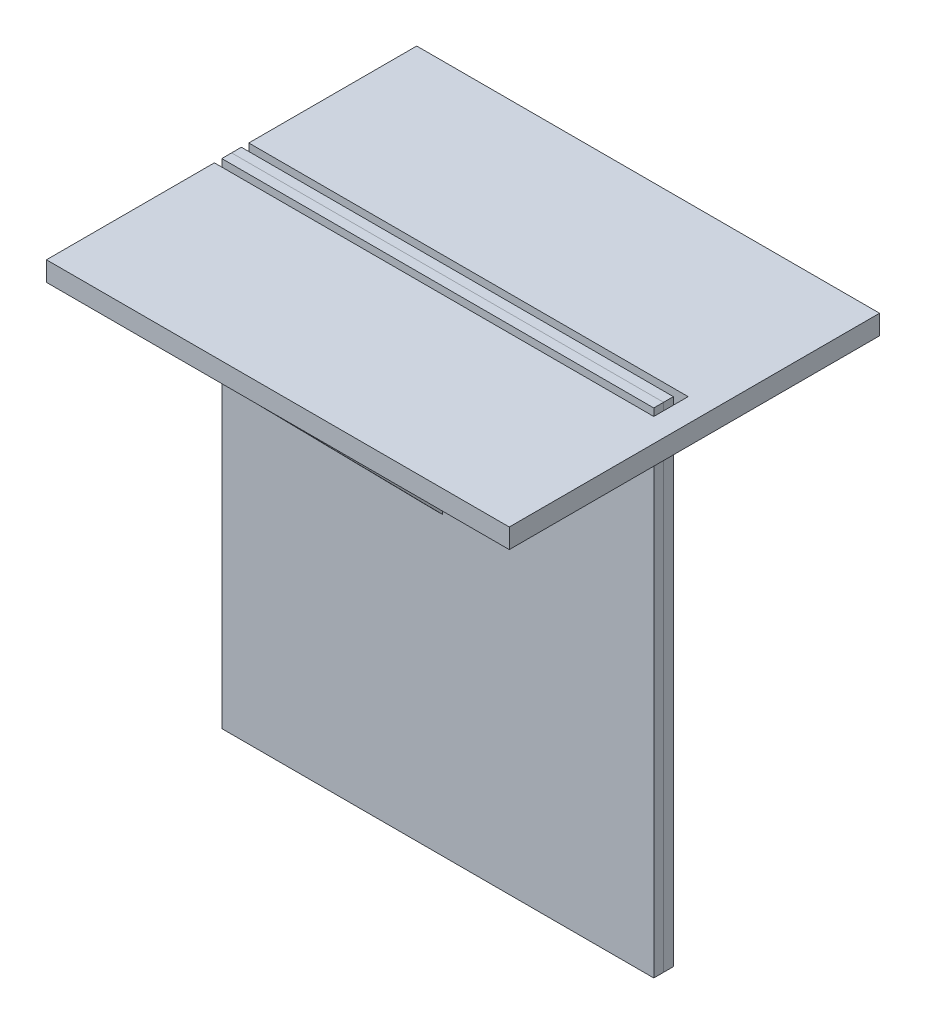
ISO-10303-21;
HEADER;
FILE_DESCRIPTION(('STEP AP214'),'2;1');
FILE_NAME('part.step','',(''),(''),'','','');
FILE_SCHEMA(('AUTOMOTIVE_DESIGN { 1 0 10303 214 1 1 1 1 }'));
ENDSEC;
DATA;
#1=APPLICATION_CONTEXT('core data for automotive mechanical design processes');
#2=APPLICATION_PROTOCOL_DEFINITION('international standard','automotive_design',2000,#1);
#3=PRODUCT_CONTEXT('',#1,'mechanical');
#4=PRODUCT('Part','Part','',(#3));
#5=PRODUCT_RELATED_PRODUCT_CATEGORY('part','',(#4));
#6=PRODUCT_DEFINITION_FORMATION('','',#4);
#7=PRODUCT_DEFINITION_CONTEXT('part definition',#1,'design');
#8=PRODUCT_DEFINITION('design','',#6,#7);
#9=PRODUCT_DEFINITION_SHAPE('','',#8);
#10=(LENGTH_UNIT() NAMED_UNIT(*) SI_UNIT(.MILLI.,.METRE.));
#11=(NAMED_UNIT(*) PLANE_ANGLE_UNIT() SI_UNIT($,.RADIAN.));
#12=(NAMED_UNIT(*) SI_UNIT($,.STERADIAN.) SOLID_ANGLE_UNIT());
#13=UNCERTAINTY_MEASURE_WITH_UNIT(LENGTH_MEASURE(1.E-05),#10,'distance_accuracy_value','');
#14=(GEOMETRIC_REPRESENTATION_CONTEXT(3) GLOBAL_UNCERTAINTY_ASSIGNED_CONTEXT((#13)) GLOBAL_UNIT_ASSIGNED_CONTEXT((#10,
#11,#12)) REPRESENTATION_CONTEXT('',''));
#15=CARTESIAN_POINT('',(0.,0.,0.));
#16=DIRECTION('',(0.,0.,1.));
#17=DIRECTION('',(1.,0.,0.));
#18=AXIS2_PLACEMENT_3D('',#15,#16,#17);
#19=CARTESIAN_POINT('',(-0.79375,45.825,1.5875));
#20=DIRECTION('',(0.,-1.,0.));
#21=DIRECTION('',(0.,0.,-1.));
#22=AXIS2_PLACEMENT_3D('',#19,#20,#21);
#23=PLANE('',#22);
#24=DIRECTION('',(0.,0.,-1.));
#25=VECTOR('',#24,1.);
#26=CARTESIAN_POINT('',(0.79375,45.825,1.5875));
#27=LINE('',#26,#25);
#28=CARTESIAN_POINT('',(0.79375,45.825,30.));
#29=VERTEX_POINT('',#28);
#30=CARTESIAN_POINT('',(0.79375,45.825,1.5875));
#31=VERTEX_POINT('',#30);
#32=EDGE_CURVE('E101',#29,#31,#27,.T.);
#33=ORIENTED_EDGE('',*,*,#32,.T.);
#34=DIRECTION('',(1.,0.,0.));
#35=VECTOR('',#34,1.);
#36=CARTESIAN_POINT('',(-0.79375,45.825,1.5875));
#37=LINE('',#36,#35);
#38=CARTESIAN_POINT('',(-0.79375,45.825,1.5875));
#39=VERTEX_POINT('',#38);
#40=EDGE_CURVE('E12',#39,#31,#37,.T.);
#41=ORIENTED_EDGE('',*,*,#40,.F.);
#42=DIRECTION('',(0.,0.,-1.));
#43=VECTOR('',#42,1.);
#44=CARTESIAN_POINT('',(-0.79375,45.825,1.5875));
#45=LINE('',#44,#43);
#46=CARTESIAN_POINT('',(-0.79375,45.825,30.));
#47=VERTEX_POINT('',#46);
#48=EDGE_CURVE('E94',#47,#39,#45,.T.);
#49=ORIENTED_EDGE('',*,*,#48,.F.);
#50=DIRECTION('',(1.,0.,0.));
#51=VECTOR('',#50,1.);
#52=CARTESIAN_POINT('',(-0.79375,45.825,30.));
#53=LINE('',#52,#51);
#54=EDGE_CURVE('E102',#47,#29,#53,.T.);
#55=ORIENTED_EDGE('',*,*,#54,.T.);
#56=EDGE_LOOP('',(#33,#41,#49,#55));
#57=FACE_BOUND('',#56,.T.);
#58=ADVANCED_FACE('F54',(#57),#23,.F.);
#59=CARTESIAN_POINT('',(-0.79375,16.9341740766103,1.5875));
#60=DIRECTION('',(0.,0.,1.));
#61=DIRECTION('',(0.,-1.,0.));
#62=AXIS2_PLACEMENT_3D('',#59,#60,#61);
#63=PLANE('',#62);
#64=DIRECTION('',(0.,-1.,0.));
#65=VECTOR('',#64,1.);
#66=CARTESIAN_POINT('',(0.79375,16.9341740766103,1.5875));
#67=LINE('',#66,#65);
#68=CARTESIAN_POINT('',(0.79375,16.9341740766103,1.5875));
#69=VERTEX_POINT('',#68);
#70=EDGE_CURVE('E82',#31,#69,#67,.T.);
#71=ORIENTED_EDGE('',*,*,#70,.T.);
#72=DIRECTION('',(1.,0.,0.));
#73=VECTOR('',#72,1.);
#74=CARTESIAN_POINT('',(-0.79375,16.9341740766103,1.5875));
#75=LINE('',#74,#73);
#76=CARTESIAN_POINT('',(-0.79375,16.9341740766103,1.5875));
#77=VERTEX_POINT('',#76);
#78=EDGE_CURVE('E62',#77,#69,#75,.T.);
#79=ORIENTED_EDGE('',*,*,#78,.F.);
#80=DIRECTION('',(0.,-1.,0.));
#81=VECTOR('',#80,1.);
#82=CARTESIAN_POINT('',(-0.79375,16.9341740766103,1.5875));
#83=LINE('',#82,#81);
#84=EDGE_CURVE('E90',#39,#77,#83,.T.);
#85=ORIENTED_EDGE('',*,*,#84,.F.);
#86=ORIENTED_EDGE('',*,*,#40,.T.);
#87=EDGE_LOOP('',(#71,#79,#85,#86));
#88=FACE_BOUND('',#87,.T.);
#89=ADVANCED_FACE('F91',(#88),#63,.F.);
#90=CARTESIAN_POINT('',(-0.79375,45.825,30.));
#91=DIRECTION('',(0.,0.701179947463391,-0.712984348548575));
#92=DIRECTION('',(0.,0.712984348548575,0.701179947463391));
#93=AXIS2_PLACEMENT_3D('',#90,#91,#92);
#94=PLANE('',#93);
#95=DIRECTION('',(0.,0.712984348548575,0.701179947463391));
#96=VECTOR('',#95,1.);
#97=CARTESIAN_POINT('',(0.79375,45.825,30.));
#98=LINE('',#97,#96);
#99=EDGE_CURVE('E87',#69,#29,#98,.T.);
#100=ORIENTED_EDGE('',*,*,#99,.T.);
#101=ORIENTED_EDGE('',*,*,#54,.F.);
#102=DIRECTION('',(0.,0.712984348548575,0.701179947463391));
#103=VECTOR('',#102,1.);
#104=CARTESIAN_POINT('',(-0.79375,45.825,30.));
#105=LINE('',#104,#103);
#106=EDGE_CURVE('E70',#77,#47,#105,.T.);
#107=ORIENTED_EDGE('',*,*,#106,.F.);
#108=ORIENTED_EDGE('',*,*,#78,.T.);
#109=EDGE_LOOP('',(#100,#101,#107,#108));
#110=FACE_BOUND('',#109,.T.);
#111=ADVANCED_FACE('F109',(#110),#94,.F.);
#112=CARTESIAN_POINT('',(-0.79375,0.,0.));
#113=DIRECTION('',(-1.,0.,0.));
#114=DIRECTION('',(0.,0.,1.));
#115=AXIS2_PLACEMENT_3D('',#112,#113,#114);
#116=PLANE('',#115);
#117=ORIENTED_EDGE('',*,*,#48,.T.);
#118=ORIENTED_EDGE('',*,*,#84,.T.);
#119=ORIENTED_EDGE('',*,*,#106,.T.);
#120=EDGE_LOOP('',(#117,#118,#119));
#121=FACE_BOUND('',#120,.T.);
#122=ADVANCED_FACE('F97',(#121),#116,.T.);
#123=CARTESIAN_POINT('',(0.79375,0.,0.));
#124=DIRECTION('',(-1.,0.,0.));
#125=DIRECTION('',(0.,0.,1.));
#126=AXIS2_PLACEMENT_3D('',#123,#124,#125);
#127=PLANE('',#126);
#128=ORIENTED_EDGE('',*,*,#32,.F.);
#129=ORIENTED_EDGE('',*,*,#99,.F.);
#130=ORIENTED_EDGE('',*,*,#70,.F.);
#131=EDGE_LOOP('',(#128,#129,#130));
#132=FACE_BOUND('',#131,.T.);
#133=ADVANCED_FACE('F110',(#132),#127,.F.);
#134=CLOSED_SHELL('',(#58,#89,#111,#122,#133));
#135=MANIFOLD_SOLID_BREP('B2',#134);
#136=CARTESIAN_POINT('',(-35.,45.825,30.));
#137=DIRECTION('',(1.,0.,0.));
#138=DIRECTION('',(0.,0.,-1.));
#139=AXIS2_PLACEMENT_3D('',#136,#137,#138);
#140=PLANE('',#139);
#141=DIRECTION('',(0.,0.,-1.));
#142=VECTOR('',#141,1.);
#143=CARTESIAN_POINT('',(-35.,49.,30.));
#144=LINE('',#143,#142);
#145=CARTESIAN_POINT('',(-35.,49.,30.));
#146=VERTEX_POINT('',#145);
#147=CARTESIAN_POINT('',(-35.,49.,2.7875));
#148=VERTEX_POINT('',#147);
#149=EDGE_CURVE('E273',#146,#148,#144,.T.);
#150=ORIENTED_EDGE('',*,*,#149,.T.);
#151=DIRECTION('',(0.,1.,0.));
#152=VECTOR('',#151,1.);
#153=CARTESIAN_POINT('',(-35.,45.825,2.7875));
#154=LINE('',#153,#152);
#155=CARTESIAN_POINT('',(-35.,45.825,2.7875));
#156=VERTEX_POINT('',#155);
#157=EDGE_CURVE('E52',#156,#148,#154,.T.);
#158=ORIENTED_EDGE('',*,*,#157,.F.);
#159=DIRECTION('',(0.,0.,-1.));
#160=VECTOR('',#159,1.);
#161=CARTESIAN_POINT('',(-35.,45.825,30.));
#162=LINE('',#161,#160);
#163=CARTESIAN_POINT('',(-35.,45.825,30.));
#164=VERTEX_POINT('',#163);
#165=EDGE_CURVE('E296',#164,#156,#162,.T.);
#166=ORIENTED_EDGE('',*,*,#165,.F.);
#167=DIRECTION('',(0.,1.,0.));
#168=VECTOR('',#167,1.);
#169=CARTESIAN_POINT('',(-35.,45.825,30.));
#170=LINE('',#169,#168);
#171=EDGE_CURVE('E269',#164,#146,#170,.T.);
#172=ORIENTED_EDGE('',*,*,#171,.T.);
#173=EDGE_LOOP('',(#150,#158,#166,#172));
#174=FACE_BOUND('',#173,.T.);
#175=ADVANCED_FACE('F172',(#174),#140,.F.);
#176=CARTESIAN_POINT('',(-35.,45.825,2.7875));
#177=DIRECTION('',(0.,0.,1.));
#178=DIRECTION('',(0.,-1.,0.));
#179=AXIS2_PLACEMENT_3D('',#176,#177,#178);
#180=PLANE('',#179);
#181=DIRECTION('',(1.,0.,0.));
#182=VECTOR('',#181,1.);
#183=CARTESIAN_POINT('',(-35.,49.,2.7875));
#184=LINE('',#183,#182);
#185=CARTESIAN_POINT('',(36.2,49.,2.7875));
#186=VERTEX_POINT('',#185);
#187=EDGE_CURVE('E277',#148,#186,#184,.T.);
#188=ORIENTED_EDGE('',*,*,#187,.T.);
#189=DIRECTION('',(0.,1.,0.));
#190=VECTOR('',#189,1.);
#191=CARTESIAN_POINT('',(36.2,45.825,2.7875));
#192=LINE('',#191,#190);
#193=CARTESIAN_POINT('',(36.2,45.825,2.7875));
#194=VERTEX_POINT('',#193);
#195=EDGE_CURVE('E181',#194,#186,#192,.T.);
#196=ORIENTED_EDGE('',*,*,#195,.F.);
#197=DIRECTION('',(1.,0.,0.));
#198=VECTOR('',#197,1.);
#199=CARTESIAN_POINT('',(-35.,45.825,2.7875));
#200=LINE('',#199,#198);
#201=EDGE_CURVE('E232',#156,#194,#200,.T.);
#202=ORIENTED_EDGE('',*,*,#201,.F.);
#203=ORIENTED_EDGE('',*,*,#157,.T.);
#204=EDGE_LOOP('',(#188,#196,#202,#203));
#205=FACE_BOUND('',#204,.T.);
#206=ADVANCED_FACE('F317',(#205),#180,.F.);
#207=CARTESIAN_POINT('',(36.2,45.825,0.));
#208=DIRECTION('',(1.,0.,0.));
#209=DIRECTION('',(0.,1.,0.));
#210=AXIS2_PLACEMENT_3D('',#207,#208,#209);
#211=PLANE('',#210);
#212=DIRECTION('',(0.,0.,-1.));
#213=VECTOR('',#212,1.);
#214=CARTESIAN_POINT('',(36.2,49.,0.));
#215=LINE('',#214,#213);
#216=CARTESIAN_POINT('',(36.2,49.,-2.7875));
#217=VERTEX_POINT('',#216);
#218=EDGE_CURVE('E281',#186,#217,#215,.T.);
#219=ORIENTED_EDGE('',*,*,#218,.T.);
#220=DIRECTION('',(0.,1.,0.));
#221=VECTOR('',#220,1.);
#222=CARTESIAN_POINT('',(36.2,45.825,-2.7875));
#223=LINE('',#222,#221);
#224=CARTESIAN_POINT('',(36.2,45.825,-2.7875));
#225=VERTEX_POINT('',#224);
#226=EDGE_CURVE('E307',#225,#217,#223,.T.);
#227=ORIENTED_EDGE('',*,*,#226,.F.);
#228=DIRECTION('',(0.,0.,-1.));
#229=VECTOR('',#228,1.);
#230=CARTESIAN_POINT('',(36.2,45.825,2.7875));
#231=LINE('',#230,#229);
#232=EDGE_CURVE('E316',#194,#225,#231,.T.);
#233=ORIENTED_EDGE('',*,*,#232,.F.);
#234=ORIENTED_EDGE('',*,*,#195,.T.);
#235=EDGE_LOOP('',(#219,#227,#233,#234));
#236=FACE_BOUND('',#235,.T.);
#237=ADVANCED_FACE('F314',(#236),#211,.F.);
#238=CARTESIAN_POINT('',(36.2,45.825,-2.7875));
#239=DIRECTION('',(0.,0.,-1.));
#240=DIRECTION('',(0.,1.,0.));
#241=AXIS2_PLACEMENT_3D('',#238,#239,#240);
#242=PLANE('',#241);
#243=DIRECTION('',(-1.,0.,0.));
#244=VECTOR('',#243,1.);
#245=CARTESIAN_POINT('',(36.2,49.,-2.7875));
#246=LINE('',#245,#244);
#247=CARTESIAN_POINT('',(-35.,49.,-2.7875));
#248=VERTEX_POINT('',#247);
#249=EDGE_CURVE('E284',#217,#248,#246,.T.);
#250=ORIENTED_EDGE('',*,*,#249,.T.);
#251=DIRECTION('',(0.,1.,0.));
#252=VECTOR('',#251,1.);
#253=CARTESIAN_POINT('',(-35.,45.825,-2.7875));
#254=LINE('',#253,#252);
#255=CARTESIAN_POINT('',(-35.,45.825,-2.7875));
#256=VERTEX_POINT('',#255);
#257=EDGE_CURVE('E303',#256,#248,#254,.T.);
#258=ORIENTED_EDGE('',*,*,#257,.F.);
#259=DIRECTION('',(-1.,0.,0.));
#260=VECTOR('',#259,1.);
#261=CARTESIAN_POINT('',(36.2,45.825,-2.7875));
#262=LINE('',#261,#260);
#263=EDGE_CURVE('E331',#225,#256,#262,.T.);
#264=ORIENTED_EDGE('',*,*,#263,.F.);
#265=ORIENTED_EDGE('',*,*,#226,.T.);
#266=EDGE_LOOP('',(#250,#258,#264,#265));
#267=FACE_BOUND('',#266,.T.);
#268=ADVANCED_FACE('F326',(#267),#242,.F.);
#269=CARTESIAN_POINT('',(-35.,45.825,-2.7875));
#270=DIRECTION('',(1.,0.,0.));
#271=DIRECTION('',(0.,0.,-1.));
#272=AXIS2_PLACEMENT_3D('',#269,#270,#271);
#273=PLANE('',#272);
#274=DIRECTION('',(0.,0.,-1.));
#275=VECTOR('',#274,1.);
#276=CARTESIAN_POINT('',(-35.,49.,-2.7875));
#277=LINE('',#276,#275);
#278=CARTESIAN_POINT('',(-35.,49.,-30.));
#279=VERTEX_POINT('',#278);
#280=EDGE_CURVE('E287',#248,#279,#277,.T.);
#281=ORIENTED_EDGE('',*,*,#280,.T.);
#282=DIRECTION('',(0.,1.,0.));
#283=VECTOR('',#282,1.);
#284=CARTESIAN_POINT('',(-35.,45.825,-30.));
#285=LINE('',#284,#283);
#286=CARTESIAN_POINT('',(-35.,45.825,-30.));
#287=VERTEX_POINT('',#286);
#288=EDGE_CURVE('E262',#287,#279,#285,.T.);
#289=ORIENTED_EDGE('',*,*,#288,.F.);
#290=DIRECTION('',(0.,0.,-1.));
#291=VECTOR('',#290,1.);
#292=CARTESIAN_POINT('',(-35.,45.825,-2.7875));
#293=LINE('',#292,#291);
#294=EDGE_CURVE('E251',#256,#287,#293,.T.);
#295=ORIENTED_EDGE('',*,*,#294,.F.);
#296=ORIENTED_EDGE('',*,*,#257,.T.);
#297=EDGE_LOOP('',(#281,#289,#295,#296));
#298=FACE_BOUND('',#297,.T.);
#299=ADVANCED_FACE('F329',(#298),#273,.F.);
#300=CARTESIAN_POINT('',(-35.,45.825,-30.));
#301=DIRECTION('',(0.,0.,1.));
#302=DIRECTION('',(1.,0.,0.));
#303=AXIS2_PLACEMENT_3D('',#300,#301,#302);
#304=PLANE('',#303);
#305=DIRECTION('',(1.,0.,0.));
#306=VECTOR('',#305,1.);
#307=CARTESIAN_POINT('',(-35.,49.,-30.));
#308=LINE('',#307,#306);
#309=CARTESIAN_POINT('',(40.,49.,-30.));
#310=VERTEX_POINT('',#309);
#311=EDGE_CURVE('E260',#279,#310,#308,.T.);
#312=ORIENTED_EDGE('',*,*,#311,.T.);
#313=DIRECTION('',(0.,1.,0.));
#314=VECTOR('',#313,1.);
#315=CARTESIAN_POINT('',(40.,45.825,-30.));
#316=LINE('',#315,#314);
#317=CARTESIAN_POINT('',(40.,45.825,-30.));
#318=VERTEX_POINT('',#317);
#319=EDGE_CURVE('E257',#318,#310,#316,.T.);
#320=ORIENTED_EDGE('',*,*,#319,.F.);
#321=DIRECTION('',(1.,0.,0.));
#322=VECTOR('',#321,1.);
#323=CARTESIAN_POINT('',(-35.,45.825,-30.));
#324=LINE('',#323,#322);
#325=EDGE_CURVE('E245',#287,#318,#324,.T.);
#326=ORIENTED_EDGE('',*,*,#325,.F.);
#327=ORIENTED_EDGE('',*,*,#288,.T.);
#328=EDGE_LOOP('',(#312,#320,#326,#327));
#329=FACE_BOUND('',#328,.T.);
#330=ADVANCED_FACE('F258',(#329),#304,.F.);
#331=CARTESIAN_POINT('',(40.,45.825,30.));
#332=DIRECTION('',(-1.,0.,0.));
#333=DIRECTION('',(0.,-1.,0.));
#334=AXIS2_PLACEMENT_3D('',#331,#332,#333);
#335=PLANE('',#334);
#336=DIRECTION('',(0.,0.,1.));
#337=VECTOR('',#336,1.);
#338=CARTESIAN_POINT('',(40.,49.,30.));
#339=LINE('',#338,#337);
#340=CARTESIAN_POINT('',(40.,49.,30.));
#341=VERTEX_POINT('',#340);
#342=EDGE_CURVE('E218',#310,#341,#339,.T.);
#343=ORIENTED_EDGE('',*,*,#342,.T.);
#344=DIRECTION('',(0.,1.,0.));
#345=VECTOR('',#344,1.);
#346=CARTESIAN_POINT('',(40.,45.825,30.));
#347=LINE('',#346,#345);
#348=CARTESIAN_POINT('',(40.,45.825,30.));
#349=VERTEX_POINT('',#348);
#350=EDGE_CURVE('E263',#349,#341,#347,.T.);
#351=ORIENTED_EDGE('',*,*,#350,.F.);
#352=DIRECTION('',(0.,0.,1.));
#353=VECTOR('',#352,1.);
#354=CARTESIAN_POINT('',(40.,45.825,30.));
#355=LINE('',#354,#353);
#356=EDGE_CURVE('E249',#318,#349,#355,.T.);
#357=ORIENTED_EDGE('',*,*,#356,.F.);
#358=ORIENTED_EDGE('',*,*,#319,.T.);
#359=EDGE_LOOP('',(#343,#351,#357,#358));
#360=FACE_BOUND('',#359,.T.);
#361=ADVANCED_FACE('F265',(#360),#335,.F.);
#362=CARTESIAN_POINT('',(-35.,45.825,30.));
#363=DIRECTION('',(0.,0.,-1.));
#364=DIRECTION('',(-1.,0.,0.));
#365=AXIS2_PLACEMENT_3D('',#362,#363,#364);
#366=PLANE('',#365);
#367=DIRECTION('',(-1.,0.,0.));
#368=VECTOR('',#367,1.);
#369=CARTESIAN_POINT('',(-35.,49.,30.));
#370=LINE('',#369,#368);
#371=EDGE_CURVE('E224',#341,#146,#370,.T.);
#372=ORIENTED_EDGE('',*,*,#371,.T.);
#373=ORIENTED_EDGE('',*,*,#171,.F.);
#374=DIRECTION('',(-1.,0.,0.));
#375=VECTOR('',#374,1.);
#376=CARTESIAN_POINT('',(-35.,45.825,30.));
#377=LINE('',#376,#375);
#378=EDGE_CURVE('E189',#349,#164,#377,.T.);
#379=ORIENTED_EDGE('',*,*,#378,.F.);
#380=ORIENTED_EDGE('',*,*,#350,.T.);
#381=EDGE_LOOP('',(#372,#373,#379,#380));
#382=FACE_BOUND('',#381,.T.);
#383=ADVANCED_FACE('F342',(#382),#366,.F.);
#384=CARTESIAN_POINT('',(0.,45.825,0.));
#385=DIRECTION('',(0.,-1.,0.));
#386=DIRECTION('',(0.,0.,-1.));
#387=AXIS2_PLACEMENT_3D('',#384,#385,#386);
#388=PLANE('',#387);
#389=ORIENTED_EDGE('',*,*,#165,.T.);
#390=ORIENTED_EDGE('',*,*,#201,.T.);
#391=ORIENTED_EDGE('',*,*,#232,.T.);
#392=ORIENTED_EDGE('',*,*,#263,.T.);
#393=ORIENTED_EDGE('',*,*,#294,.T.);
#394=ORIENTED_EDGE('',*,*,#325,.T.);
#395=ORIENTED_EDGE('',*,*,#356,.T.);
#396=ORIENTED_EDGE('',*,*,#378,.T.);
#397=EDGE_LOOP('',(#389,#390,#391,#392,#393,#394,#395,#396));
#398=FACE_BOUND('',#397,.T.);
#399=ADVANCED_FACE('F247',(#398),#388,.T.);
#400=CARTESIAN_POINT('',(0.,49.,0.));
#401=DIRECTION('',(0.,-1.,0.));
#402=DIRECTION('',(0.,0.,-1.));
#403=AXIS2_PLACEMENT_3D('',#400,#401,#402);
#404=PLANE('',#403);
#405=ORIENTED_EDGE('',*,*,#149,.F.);
#406=ORIENTED_EDGE('',*,*,#371,.F.);
#407=ORIENTED_EDGE('',*,*,#342,.F.);
#408=ORIENTED_EDGE('',*,*,#311,.F.);
#409=ORIENTED_EDGE('',*,*,#280,.F.);
#410=ORIENTED_EDGE('',*,*,#249,.F.);
#411=ORIENTED_EDGE('',*,*,#218,.F.);
#412=ORIENTED_EDGE('',*,*,#187,.F.);
#413=EDGE_LOOP('',(#405,#406,#407,#408,#409,#410,#411,#412));
#414=FACE_BOUND('',#413,.T.);
#415=ADVANCED_FACE('F321',(#414),#404,.F.);
#416=CLOSED_SHELL('',(#175,#206,#237,#268,#299,#330,#361,#383,#399,#415));
#417=MANIFOLD_SOLID_BREP('B6',#416);
#418=CARTESIAN_POINT('',(0.,0.,-1.5875));
#419=DIRECTION('',(0.,0.,-1.));
#420=DIRECTION('',(-1.,0.,0.));
#421=AXIS2_PLACEMENT_3D('',#418,#419,#420);
#422=PLANE('',#421);
#423=DIRECTION('',(1.,0.,0.));
#424=VECTOR('',#423,1.);
#425=CARTESIAN_POINT('',(-35.,49.,-1.5875));
#426=LINE('',#425,#424);
#427=CARTESIAN_POINT('',(-35.,49.,-1.5875));
#428=VERTEX_POINT('',#427);
#429=CARTESIAN_POINT('',(35.,49.,-1.5875));
#430=VERTEX_POINT('',#429);
#431=EDGE_CURVE('E508',#428,#430,#426,.T.);
#432=ORIENTED_EDGE('',*,*,#431,.T.);
#433=DIRECTION('',(0.,-1.,0.));
#434=VECTOR('',#433,1.);
#435=CARTESIAN_POINT('',(35.,49.,-1.5875));
#436=LINE('',#435,#434);
#437=CARTESIAN_POINT('',(35.,-31.,-1.5875));
#438=VERTEX_POINT('',#437);
#439=EDGE_CURVE('E503',#430,#438,#436,.T.);
#440=ORIENTED_EDGE('',*,*,#439,.T.);
#441=DIRECTION('',(-1.,0.,0.));
#442=VECTOR('',#441,1.);
#443=CARTESIAN_POINT('',(35.,-31.,-1.5875));
#444=LINE('',#443,#442);
#445=CARTESIAN_POINT('',(-35.,-31.,-1.5875));
#446=VERTEX_POINT('',#445);
#447=EDGE_CURVE('E506',#438,#446,#444,.T.);
#448=ORIENTED_EDGE('',*,*,#447,.T.);
#449=DIRECTION('',(0.,1.,0.));
#450=VECTOR('',#449,1.);
#451=CARTESIAN_POINT('',(-35.,-31.,-1.5875));
#452=LINE('',#451,#450);
#453=EDGE_CURVE('E473',#446,#428,#452,.T.);
#454=ORIENTED_EDGE('',*,*,#453,.T.);
#455=EDGE_LOOP('',(#432,#440,#448,#454));
#456=FACE_BOUND('',#455,.T.);
#457=CARTESIAN_POINT('',(0.,0.,-1.5875));
#458=DIRECTION('',(0.,0.,-1.));
#459=DIRECTION('',(-1.,0.,0.));
#460=AXIS2_PLACEMENT_3D('',#457,#458,#459);
#461=CIRCLE('',#460,18.2500000000008);
#462=CARTESIAN_POINT('',(-18.2500000000008,0.,-1.5875));
#463=VERTEX_POINT('',#462);
#464=EDGE_CURVE('E523',#463,#463,#461,.T.);
#465=ORIENTED_EDGE('',*,*,#464,.F.);
#466=EDGE_LOOP('',(#465));
#467=FACE_BOUND('',#466,.T.);
#468=ADVANCED_FACE('F456',(#456,#467),#422,.T.);
#469=CARTESIAN_POINT('',(0.,0.,0.));
#470=DIRECTION('',(0.,0.,-1.));
#471=DIRECTION('',(-1.,0.,0.));
#472=AXIS2_PLACEMENT_3D('',#469,#470,#471);
#473=PLANE('',#472);
#474=DIRECTION('',(1.,0.,0.));
#475=VECTOR('',#474,1.);
#476=CARTESIAN_POINT('',(-35.,49.,0.));
#477=LINE('',#476,#475);
#478=CARTESIAN_POINT('',(-35.,49.,0.));
#479=VERTEX_POINT('',#478);
#480=CARTESIAN_POINT('',(35.,49.,0.));
#481=VERTEX_POINT('',#480);
#482=EDGE_CURVE('E520',#479,#481,#477,.T.);
#483=ORIENTED_EDGE('',*,*,#482,.F.);
#484=DIRECTION('',(0.,1.,0.));
#485=VECTOR('',#484,1.);
#486=CARTESIAN_POINT('',(-35.,-31.,0.));
#487=LINE('',#486,#485);
#488=CARTESIAN_POINT('',(-35.,-31.,0.));
#489=VERTEX_POINT('',#488);
#490=EDGE_CURVE('E496',#489,#479,#487,.T.);
#491=ORIENTED_EDGE('',*,*,#490,.F.);
#492=DIRECTION('',(-1.,0.,0.));
#493=VECTOR('',#492,1.);
#494=CARTESIAN_POINT('',(35.,-31.,0.));
#495=LINE('',#494,#493);
#496=CARTESIAN_POINT('',(35.,-31.,0.));
#497=VERTEX_POINT('',#496);
#498=EDGE_CURVE('E490',#497,#489,#495,.T.);
#499=ORIENTED_EDGE('',*,*,#498,.F.);
#500=DIRECTION('',(0.,-1.,0.));
#501=VECTOR('',#500,1.);
#502=CARTESIAN_POINT('',(35.,49.,0.));
#503=LINE('',#502,#501);
#504=EDGE_CURVE('E512',#481,#497,#503,.T.);
#505=ORIENTED_EDGE('',*,*,#504,.F.);
#506=EDGE_LOOP('',(#483,#491,#499,#505));
#507=FACE_BOUND('',#506,.T.);
#508=CARTESIAN_POINT('',(0.,0.,0.));
#509=DIRECTION('',(0.,0.,-1.));
#510=DIRECTION('',(-1.,0.,0.));
#511=AXIS2_PLACEMENT_3D('',#508,#509,#510);
#512=CIRCLE('',#511,18.2500000000008);
#513=CARTESIAN_POINT('',(-18.2500000000008,0.,0.));
#514=VERTEX_POINT('',#513);
#515=EDGE_CURVE('E535',#514,#514,#512,.T.);
#516=ORIENTED_EDGE('',*,*,#515,.T.);
#517=EDGE_LOOP('',(#516));
#518=FACE_BOUND('',#517,.T.);
#519=ADVANCED_FACE('F531',(#507,#518),#473,.F.);
#520=CARTESIAN_POINT('',(-35.,49.,-1.5875));
#521=DIRECTION('',(0.,-1.,0.));
#522=DIRECTION('',(0.,0.,-1.));
#523=AXIS2_PLACEMENT_3D('',#520,#521,#522);
#524=PLANE('',#523);
#525=ORIENTED_EDGE('',*,*,#482,.T.);
#526=DIRECTION('',(0.,0.,1.));
#527=VECTOR('',#526,1.);
#528=CARTESIAN_POINT('',(35.,49.,-1.5875));
#529=LINE('',#528,#527);
#530=EDGE_CURVE('E170',#430,#481,#529,.T.);
#531=ORIENTED_EDGE('',*,*,#530,.F.);
#532=ORIENTED_EDGE('',*,*,#431,.F.);
#533=DIRECTION('',(0.,0.,1.));
#534=VECTOR('',#533,1.);
#535=CARTESIAN_POINT('',(-35.,49.,-1.5875));
#536=LINE('',#535,#534);
#537=EDGE_CURVE('E516',#428,#479,#536,.T.);
#538=ORIENTED_EDGE('',*,*,#537,.T.);
#539=EDGE_LOOP('',(#525,#531,#532,#538));
#540=FACE_BOUND('',#539,.T.);
#541=ADVANCED_FACE('F458',(#540),#524,.F.);
#542=CARTESIAN_POINT('',(35.,49.,-1.5875));
#543=DIRECTION('',(-1.,0.,0.));
#544=DIRECTION('',(0.,-1.,0.));
#545=AXIS2_PLACEMENT_3D('',#542,#543,#544);
#546=PLANE('',#545);
#547=ORIENTED_EDGE('',*,*,#504,.T.);
#548=DIRECTION('',(0.,0.,1.));
#549=VECTOR('',#548,1.);
#550=CARTESIAN_POINT('',(35.,-31.,-1.5875));
#551=LINE('',#550,#549);
#552=EDGE_CURVE('E465',#438,#497,#551,.T.);
#553=ORIENTED_EDGE('',*,*,#552,.F.);
#554=ORIENTED_EDGE('',*,*,#439,.F.);
#555=ORIENTED_EDGE('',*,*,#530,.T.);
#556=EDGE_LOOP('',(#547,#553,#554,#555));
#557=FACE_BOUND('',#556,.T.);
#558=ADVANCED_FACE('F511',(#557),#546,.F.);
#559=CARTESIAN_POINT('',(35.,-31.,-1.5875));
#560=DIRECTION('',(0.,1.,0.));
#561=DIRECTION('',(0.,0.,1.));
#562=AXIS2_PLACEMENT_3D('',#559,#560,#561);
#563=PLANE('',#562);
#564=ORIENTED_EDGE('',*,*,#498,.T.);
#565=DIRECTION('',(0.,0.,1.));
#566=VECTOR('',#565,1.);
#567=CARTESIAN_POINT('',(-35.,-31.,-1.5875));
#568=LINE('',#567,#566);
#569=EDGE_CURVE('E513',#446,#489,#568,.T.);
#570=ORIENTED_EDGE('',*,*,#569,.F.);
#571=ORIENTED_EDGE('',*,*,#447,.F.);
#572=ORIENTED_EDGE('',*,*,#552,.T.);
#573=EDGE_LOOP('',(#564,#570,#571,#572));
#574=FACE_BOUND('',#573,.T.);
#575=ADVANCED_FACE('F514',(#574),#563,.F.);
#576=CARTESIAN_POINT('',(-35.,-31.,-1.5875));
#577=DIRECTION('',(1.,0.,0.));
#578=DIRECTION('',(0.,1.,0.));
#579=AXIS2_PLACEMENT_3D('',#576,#577,#578);
#580=PLANE('',#579);
#581=ORIENTED_EDGE('',*,*,#490,.T.);
#582=ORIENTED_EDGE('',*,*,#537,.F.);
#583=ORIENTED_EDGE('',*,*,#453,.F.);
#584=ORIENTED_EDGE('',*,*,#569,.T.);
#585=EDGE_LOOP('',(#581,#582,#583,#584));
#586=FACE_BOUND('',#585,.T.);
#587=ADVANCED_FACE('F528',(#586),#580,.F.);
#588=CARTESIAN_POINT('',(0.,0.,-1.5875));
#589=DIRECTION('',(0.,0.,1.));
#590=DIRECTION('',(1.,0.,0.));
#591=AXIS2_PLACEMENT_3D('',#588,#589,#590);
#592=CYLINDRICAL_SURFACE('',#591,18.2500000000008);
#593=ORIENTED_EDGE('',*,*,#464,.T.);
#594=EDGE_LOOP('',(#593));
#595=FACE_BOUND('',#594,.T.);
#596=ORIENTED_EDGE('',*,*,#515,.F.);
#597=EDGE_LOOP('',(#596));
#598=FACE_BOUND('',#597,.T.);
#599=ADVANCED_FACE('F541',(#595,#598),#592,.F.);
#600=CLOSED_SHELL('',(#468,#519,#541,#558,#575,#587,#599));
#601=MANIFOLD_SOLID_BREP('B46',#600);
#602=CARTESIAN_POINT('',(35.,-31.,1.5875));
#603=DIRECTION('',(-1.,0.,0.));
#604=DIRECTION('',(0.,-1.,0.));
#605=AXIS2_PLACEMENT_3D('',#602,#603,#604);
#606=PLANE('',#605);
#607=DIRECTION('',(0.,1.,0.));
#608=VECTOR('',#607,1.);
#609=CARTESIAN_POINT('',(35.,-31.,0.));
#610=LINE('',#609,#608);
#611=CARTESIAN_POINT('',(35.,-31.,0.));
#612=VERTEX_POINT('',#611);
#613=CARTESIAN_POINT('',(35.,49.,0.));
#614=VERTEX_POINT('',#613);
#615=EDGE_CURVE('E678',#612,#614,#610,.T.);
#616=ORIENTED_EDGE('',*,*,#615,.T.);
#617=DIRECTION('',(0.,0.,-1.));
#618=VECTOR('',#617,1.);
#619=CARTESIAN_POINT('',(35.,49.,1.5875));
#620=LINE('',#619,#618);
#621=CARTESIAN_POINT('',(35.,49.,1.5875));
#622=VERTEX_POINT('',#621);
#623=EDGE_CURVE('E454',#622,#614,#620,.T.);
#624=ORIENTED_EDGE('',*,*,#623,.F.);
#625=DIRECTION('',(0.,1.,0.));
#626=VECTOR('',#625,1.);
#627=CARTESIAN_POINT('',(35.,-31.,1.5875));
#628=LINE('',#627,#626);
#629=CARTESIAN_POINT('',(35.,-31.,1.5875));
#630=VERTEX_POINT('',#629);
#631=EDGE_CURVE('E666',#630,#622,#628,.T.);
#632=ORIENTED_EDGE('',*,*,#631,.F.);
#633=DIRECTION('',(0.,0.,-1.));
#634=VECTOR('',#633,1.);
#635=CARTESIAN_POINT('',(35.,-31.,1.5875));
#636=LINE('',#635,#634);
#637=EDGE_CURVE('E674',#630,#612,#636,.T.);
#638=ORIENTED_EDGE('',*,*,#637,.T.);
#639=EDGE_LOOP('',(#616,#624,#632,#638));
#640=FACE_BOUND('',#639,.T.);
#641=ADVANCED_FACE('F615',(#640),#606,.F.);
#642=CARTESIAN_POINT('',(35.,49.,1.5875));
#643=DIRECTION('',(0.,-1.,0.));
#644=DIRECTION('',(0.,0.,-1.));
#645=AXIS2_PLACEMENT_3D('',#642,#643,#644);
#646=PLANE('',#645);
#647=DIRECTION('',(-1.,0.,0.));
#648=VECTOR('',#647,1.);
#649=CARTESIAN_POINT('',(35.,49.,0.));
#650=LINE('',#649,#648);
#651=CARTESIAN_POINT('',(-35.,49.,0.));
#652=VERTEX_POINT('',#651);
#653=EDGE_CURVE('E670',#614,#652,#650,.T.);
#654=ORIENTED_EDGE('',*,*,#653,.T.);
#655=DIRECTION('',(0.,0.,-1.));
#656=VECTOR('',#655,1.);
#657=CARTESIAN_POINT('',(-35.,49.,1.5875));
#658=LINE('',#657,#656);
#659=CARTESIAN_POINT('',(-35.,49.,1.5875));
#660=VERTEX_POINT('',#659);
#661=EDGE_CURVE('E623',#660,#652,#658,.T.);
#662=ORIENTED_EDGE('',*,*,#661,.F.);
#663=DIRECTION('',(-1.,0.,0.));
#664=VECTOR('',#663,1.);
#665=CARTESIAN_POINT('',(35.,49.,1.5875));
#666=LINE('',#665,#664);
#667=EDGE_CURVE('E661',#622,#660,#666,.T.);
#668=ORIENTED_EDGE('',*,*,#667,.F.);
#669=ORIENTED_EDGE('',*,*,#623,.T.);
#670=EDGE_LOOP('',(#654,#662,#668,#669));
#671=FACE_BOUND('',#670,.T.);
#672=ADVANCED_FACE('F669',(#671),#646,.F.);
#673=CARTESIAN_POINT('',(-35.,-31.,1.5875));
#674=DIRECTION('',(1.,0.,0.));
#675=DIRECTION('',(0.,1.,0.));
#676=AXIS2_PLACEMENT_3D('',#673,#674,#675);
#677=PLANE('',#676);
#678=DIRECTION('',(0.,-1.,0.));
#679=VECTOR('',#678,1.);
#680=CARTESIAN_POINT('',(-35.,-31.,0.));
#681=LINE('',#680,#679);
#682=CARTESIAN_POINT('',(-35.,-31.,0.));
#683=VERTEX_POINT('',#682);
#684=EDGE_CURVE('E648',#652,#683,#681,.T.);
#685=ORIENTED_EDGE('',*,*,#684,.T.);
#686=DIRECTION('',(0.,0.,-1.));
#687=VECTOR('',#686,1.);
#688=CARTESIAN_POINT('',(-35.,-31.,1.5875));
#689=LINE('',#688,#687);
#690=CARTESIAN_POINT('',(-35.,-31.,1.5875));
#691=VERTEX_POINT('',#690);
#692=EDGE_CURVE('E671',#691,#683,#689,.T.);
#693=ORIENTED_EDGE('',*,*,#692,.F.);
#694=DIRECTION('',(0.,-1.,0.));
#695=VECTOR('',#694,1.);
#696=CARTESIAN_POINT('',(-35.,-31.,1.5875));
#697=LINE('',#696,#695);
#698=EDGE_CURVE('E664',#660,#691,#697,.T.);
#699=ORIENTED_EDGE('',*,*,#698,.F.);
#700=ORIENTED_EDGE('',*,*,#661,.T.);
#701=EDGE_LOOP('',(#685,#693,#699,#700));
#702=FACE_BOUND('',#701,.T.);
#703=ADVANCED_FACE('F672',(#702),#677,.F.);
#704=CARTESIAN_POINT('',(35.,-31.,1.5875));
#705=DIRECTION('',(0.,1.,0.));
#706=DIRECTION('',(0.,0.,1.));
#707=AXIS2_PLACEMENT_3D('',#704,#705,#706);
#708=PLANE('',#707);
#709=DIRECTION('',(1.,0.,0.));
#710=VECTOR('',#709,1.);
#711=CARTESIAN_POINT('',(35.,-31.,0.));
#712=LINE('',#711,#710);
#713=EDGE_CURVE('E654',#683,#612,#712,.T.);
#714=ORIENTED_EDGE('',*,*,#713,.T.);
#715=ORIENTED_EDGE('',*,*,#637,.F.);
#716=DIRECTION('',(1.,0.,0.));
#717=VECTOR('',#716,1.);
#718=CARTESIAN_POINT('',(35.,-31.,1.5875));
#719=LINE('',#718,#717);
#720=EDGE_CURVE('E631',#691,#630,#719,.T.);
#721=ORIENTED_EDGE('',*,*,#720,.F.);
#722=ORIENTED_EDGE('',*,*,#692,.T.);
#723=EDGE_LOOP('',(#714,#715,#721,#722));
#724=FACE_BOUND('',#723,.T.);
#725=ADVANCED_FACE('F685',(#724),#708,.F.);
#726=CARTESIAN_POINT('',(0.,0.,1.5875));
#727=DIRECTION('',(0.,0.,1.));
#728=DIRECTION('',(1.,0.,0.));
#729=AXIS2_PLACEMENT_3D('',#726,#727,#728);
#730=PLANE('',#729);
#731=ORIENTED_EDGE('',*,*,#631,.T.);
#732=ORIENTED_EDGE('',*,*,#667,.T.);
#733=ORIENTED_EDGE('',*,*,#698,.T.);
#734=ORIENTED_EDGE('',*,*,#720,.T.);
#735=EDGE_LOOP('',(#731,#732,#733,#734));
#736=FACE_BOUND('',#735,.T.);
#737=ADVANCED_FACE('F662',(#736),#730,.T.);
#738=CARTESIAN_POINT('',(0.,0.,0.));
#739=DIRECTION('',(0.,0.,1.));
#740=DIRECTION('',(1.,0.,0.));
#741=AXIS2_PLACEMENT_3D('',#738,#739,#740);
#742=PLANE('',#741);
#743=ORIENTED_EDGE('',*,*,#615,.F.);
#744=ORIENTED_EDGE('',*,*,#713,.F.);
#745=ORIENTED_EDGE('',*,*,#684,.F.);
#746=ORIENTED_EDGE('',*,*,#653,.F.);
#747=EDGE_LOOP('',(#743,#744,#745,#746));
#748=FACE_BOUND('',#747,.T.);
#749=ADVANCED_FACE('F688',(#748),#742,.F.);
#750=CLOSED_SHELL('',(#641,#672,#703,#725,#737,#749));
#751=MANIFOLD_SOLID_BREP('B164',#750);
#752=ADVANCED_BREP_SHAPE_REPRESENTATION('',(#18,#135,#417,#601,#751),#14);
#753=SHAPE_DEFINITION_REPRESENTATION(#9,#752);
ENDSEC;
END-ISO-10303-21;
